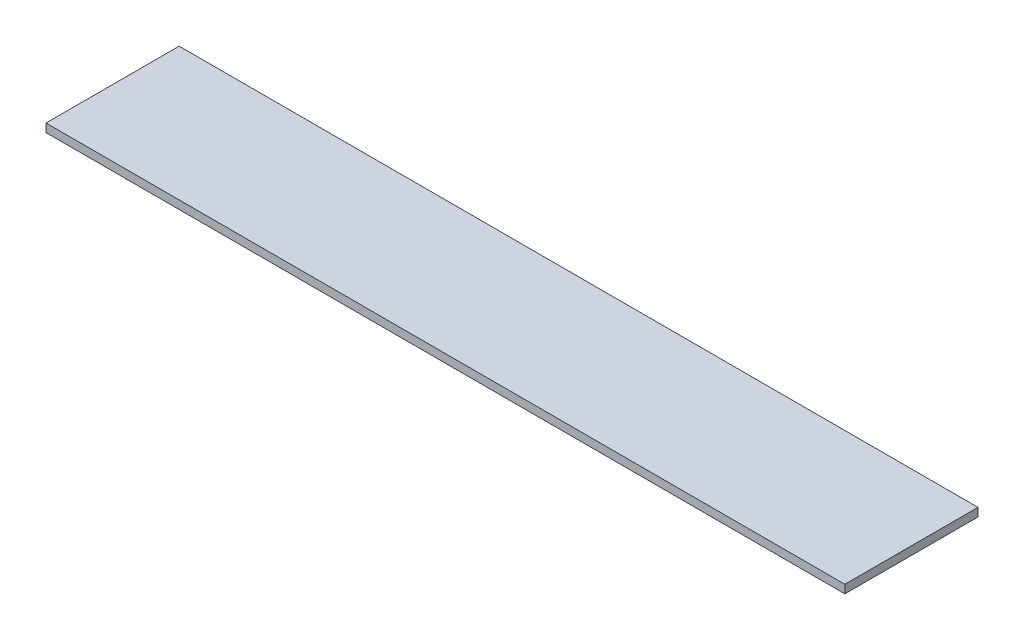
ISO-10303-21;
HEADER;
FILE_DESCRIPTION(('STEP AP214'),'2;1');
FILE_NAME('part.step','',(''),(''),'','','');
FILE_SCHEMA(('AUTOMOTIVE_DESIGN { 1 0 10303 214 1 1 1 1 }'));
ENDSEC;
DATA;
#1=APPLICATION_CONTEXT('core data for automotive mechanical design processes');
#2=APPLICATION_PROTOCOL_DEFINITION('international standard','automotive_design',2000,#1);
#3=PRODUCT_CONTEXT('',#1,'mechanical');
#4=PRODUCT('Part','Part','',(#3));
#5=PRODUCT_RELATED_PRODUCT_CATEGORY('part','',(#4));
#6=PRODUCT_DEFINITION_FORMATION('','',#4);
#7=PRODUCT_DEFINITION_CONTEXT('part definition',#1,'design');
#8=PRODUCT_DEFINITION('design','',#6,#7);
#9=PRODUCT_DEFINITION_SHAPE('','',#8);
#10=(LENGTH_UNIT() NAMED_UNIT(*) SI_UNIT(.MILLI.,.METRE.));
#11=(NAMED_UNIT(*) PLANE_ANGLE_UNIT() SI_UNIT($,.RADIAN.));
#12=(NAMED_UNIT(*) SI_UNIT($,.STERADIAN.) SOLID_ANGLE_UNIT());
#13=UNCERTAINTY_MEASURE_WITH_UNIT(LENGTH_MEASURE(1.E-05),#10,'distance_accuracy_value','');
#14=(GEOMETRIC_REPRESENTATION_CONTEXT(3) GLOBAL_UNCERTAINTY_ASSIGNED_CONTEXT((#13)) GLOBAL_UNIT_ASSIGNED_CONTEXT((#10,
#11,#12)) REPRESENTATION_CONTEXT('',''));
#15=CARTESIAN_POINT('',(0.,0.,0.));
#16=DIRECTION('',(0.,0.,1.));
#17=DIRECTION('',(1.,0.,0.));
#18=AXIS2_PLACEMENT_3D('',#15,#16,#17);
#19=CARTESIAN_POINT('',(0.,1.5875,0.));
#20=DIRECTION('',(1.,0.,0.));
#21=DIRECTION('',(0.,0.,-1.));
#22=AXIS2_PLACEMENT_3D('',#19,#20,#21);
#23=PLANE('',#22);
#24=DIRECTION('',(0.,0.,1.));
#25=VECTOR('',#24,1.);
#26=CARTESIAN_POINT('',(0.,0.,0.));
#27=LINE('',#26,#25);
#28=CARTESIAN_POINT('',(0.,0.,-25.4));
#29=VERTEX_POINT('',#28);
#30=CARTESIAN_POINT('',(0.,0.,0.));
#31=VERTEX_POINT('',#30);
#32=EDGE_CURVE('E95',#29,#31,#27,.T.);
#33=ORIENTED_EDGE('',*,*,#32,.T.);
#34=DIRECTION('',(0.,-1.,0.));
#35=VECTOR('',#34,1.);
#36=CARTESIAN_POINT('',(0.,1.5875,0.));
#37=LINE('',#36,#35);
#38=CARTESIAN_POINT('',(0.,1.5875,0.));
#39=VERTEX_POINT('',#38);
#40=EDGE_CURVE('E11',#39,#31,#37,.T.);
#41=ORIENTED_EDGE('',*,*,#40,.F.);
#42=DIRECTION('',(0.,0.,1.));
#43=VECTOR('',#42,1.);
#44=CARTESIAN_POINT('',(0.,1.5875,0.));
#45=LINE('',#44,#43);
#46=CARTESIAN_POINT('',(0.,1.5875,-25.4));
#47=VERTEX_POINT('',#46);
#48=EDGE_CURVE('E83',#47,#39,#45,.T.);
#49=ORIENTED_EDGE('',*,*,#48,.F.);
#50=DIRECTION('',(0.,-1.,0.));
#51=VECTOR('',#50,1.);
#52=CARTESIAN_POINT('',(0.,1.5875,-25.4));
#53=LINE('',#52,#51);
#54=EDGE_CURVE('E91',#47,#29,#53,.T.);
#55=ORIENTED_EDGE('',*,*,#54,.T.);
#56=EDGE_LOOP('',(#33,#41,#49,#55));
#57=FACE_BOUND('',#56,.T.);
#58=ADVANCED_FACE('F32',(#57),#23,.F.);
#59=CARTESIAN_POINT('',(0.,1.5875,0.));
#60=DIRECTION('',(0.,0.,-1.));
#61=DIRECTION('',(-1.,0.,0.));
#62=AXIS2_PLACEMENT_3D('',#59,#60,#61);
#63=PLANE('',#62);
#64=DIRECTION('',(1.,0.,0.));
#65=VECTOR('',#64,1.);
#66=CARTESIAN_POINT('',(0.,0.,0.));
#67=LINE('',#66,#65);
#68=CARTESIAN_POINT('',(152.4,0.,0.));
#69=VERTEX_POINT('',#68);
#70=EDGE_CURVE('E87',#31,#69,#67,.T.);
#71=ORIENTED_EDGE('',*,*,#70,.T.);
#72=DIRECTION('',(0.,-1.,0.));
#73=VECTOR('',#72,1.);
#74=CARTESIAN_POINT('',(152.4,1.5875,0.));
#75=LINE('',#74,#73);
#76=CARTESIAN_POINT('',(152.4,1.5875,0.));
#77=VERTEX_POINT('',#76);
#78=EDGE_CURVE('E40',#77,#69,#75,.T.);
#79=ORIENTED_EDGE('',*,*,#78,.F.);
#80=DIRECTION('',(1.,0.,0.));
#81=VECTOR('',#80,1.);
#82=CARTESIAN_POINT('',(0.,1.5875,0.));
#83=LINE('',#82,#81);
#84=EDGE_CURVE('E78',#39,#77,#83,.T.);
#85=ORIENTED_EDGE('',*,*,#84,.F.);
#86=ORIENTED_EDGE('',*,*,#40,.T.);
#87=EDGE_LOOP('',(#71,#79,#85,#86));
#88=FACE_BOUND('',#87,.T.);
#89=ADVANCED_FACE('F86',(#88),#63,.F.);
#90=CARTESIAN_POINT('',(152.4,1.5875,0.));
#91=DIRECTION('',(-1.,0.,0.));
#92=DIRECTION('',(0.,0.,1.));
#93=AXIS2_PLACEMENT_3D('',#90,#91,#92);
#94=PLANE('',#93);
#95=DIRECTION('',(0.,0.,-1.));
#96=VECTOR('',#95,1.);
#97=CARTESIAN_POINT('',(152.4,0.,0.));
#98=LINE('',#97,#96);
#99=CARTESIAN_POINT('',(152.4,0.,-25.4));
#100=VERTEX_POINT('',#99);
#101=EDGE_CURVE('E65',#69,#100,#98,.T.);
#102=ORIENTED_EDGE('',*,*,#101,.T.);
#103=DIRECTION('',(0.,-1.,0.));
#104=VECTOR('',#103,1.);
#105=CARTESIAN_POINT('',(152.4,1.5875,-25.4));
#106=LINE('',#105,#104);
#107=CARTESIAN_POINT('',(152.4,1.5875,-25.4));
#108=VERTEX_POINT('',#107);
#109=EDGE_CURVE('E88',#108,#100,#106,.T.);
#110=ORIENTED_EDGE('',*,*,#109,.F.);
#111=DIRECTION('',(0.,0.,-1.));
#112=VECTOR('',#111,1.);
#113=CARTESIAN_POINT('',(152.4,1.5875,0.));
#114=LINE('',#113,#112);
#115=EDGE_CURVE('E81',#77,#108,#114,.T.);
#116=ORIENTED_EDGE('',*,*,#115,.F.);
#117=ORIENTED_EDGE('',*,*,#78,.T.);
#118=EDGE_LOOP('',(#102,#110,#116,#117));
#119=FACE_BOUND('',#118,.T.);
#120=ADVANCED_FACE('F89',(#119),#94,.F.);
#121=CARTESIAN_POINT('',(0.,1.5875,-25.4));
#122=DIRECTION('',(0.,0.,1.));
#123=DIRECTION('',(1.,0.,0.));
#124=AXIS2_PLACEMENT_3D('',#121,#122,#123);
#125=PLANE('',#124);
#126=DIRECTION('',(-1.,0.,0.));
#127=VECTOR('',#126,1.);
#128=CARTESIAN_POINT('',(0.,0.,-25.4));
#129=LINE('',#128,#127);
#130=EDGE_CURVE('E71',#100,#29,#129,.T.);
#131=ORIENTED_EDGE('',*,*,#130,.T.);
#132=ORIENTED_EDGE('',*,*,#54,.F.);
#133=DIRECTION('',(-1.,0.,0.));
#134=VECTOR('',#133,1.);
#135=CARTESIAN_POINT('',(0.,1.5875,-25.4));
#136=LINE('',#135,#134);
#137=EDGE_CURVE('E48',#108,#47,#136,.T.);
#138=ORIENTED_EDGE('',*,*,#137,.F.);
#139=ORIENTED_EDGE('',*,*,#109,.T.);
#140=EDGE_LOOP('',(#131,#132,#138,#139));
#141=FACE_BOUND('',#140,.T.);
#142=ADVANCED_FACE('F102',(#141),#125,.F.);
#143=CARTESIAN_POINT('',(0.,1.5875,0.));
#144=DIRECTION('',(0.,-1.,0.));
#145=DIRECTION('',(0.,0.,-1.));
#146=AXIS2_PLACEMENT_3D('',#143,#144,#145);
#147=PLANE('',#146);
#148=ORIENTED_EDGE('',*,*,#48,.T.);
#149=ORIENTED_EDGE('',*,*,#84,.T.);
#150=ORIENTED_EDGE('',*,*,#115,.T.);
#151=ORIENTED_EDGE('',*,*,#137,.T.);
#152=EDGE_LOOP('',(#148,#149,#150,#151));
#153=FACE_BOUND('',#152,.T.);
#154=ADVANCED_FACE('F79',(#153),#147,.F.);
#155=CARTESIAN_POINT('',(0.,0.,0.));
#156=DIRECTION('',(0.,-1.,0.));
#157=DIRECTION('',(0.,0.,-1.));
#158=AXIS2_PLACEMENT_3D('',#155,#156,#157);
#159=PLANE('',#158);
#160=ORIENTED_EDGE('',*,*,#32,.F.);
#161=ORIENTED_EDGE('',*,*,#130,.F.);
#162=ORIENTED_EDGE('',*,*,#101,.F.);
#163=ORIENTED_EDGE('',*,*,#70,.F.);
#164=EDGE_LOOP('',(#160,#161,#162,#163));
#165=FACE_BOUND('',#164,.T.);
#166=ADVANCED_FACE('F105',(#165),#159,.T.);
#167=CLOSED_SHELL('',(#58,#89,#120,#142,#154,#166));
#168=MANIFOLD_SOLID_BREP('B2',#167);
#169=ADVANCED_BREP_SHAPE_REPRESENTATION('',(#18,#168),#14);
#170=SHAPE_DEFINITION_REPRESENTATION(#9,#169);
ENDSEC;
END-ISO-10303-21;
